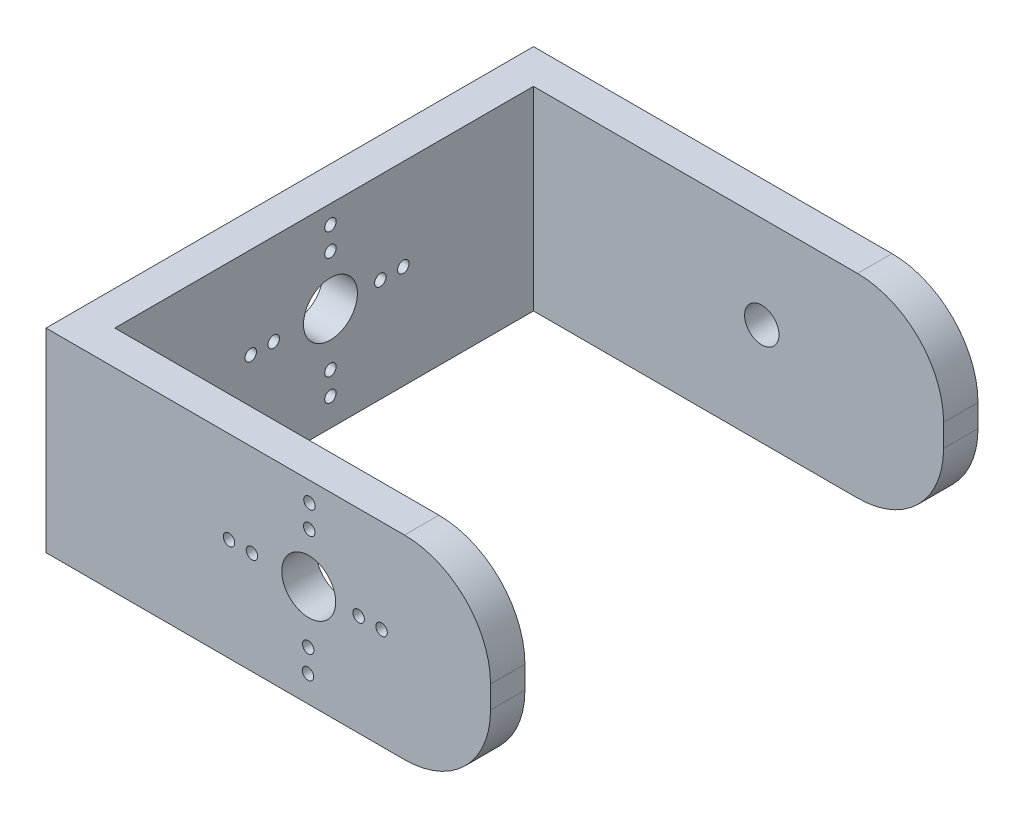
ISO-10303-21;
HEADER;
FILE_DESCRIPTION(('STEP AP214'),'2;1');
FILE_NAME('part.step','',(''),(''),'','','');
FILE_SCHEMA(('AUTOMOTIVE_DESIGN { 1 0 10303 214 1 1 1 1 }'));
ENDSEC;
DATA;
#1=APPLICATION_CONTEXT('core data for automotive mechanical design processes');
#2=APPLICATION_PROTOCOL_DEFINITION('international standard','automotive_design',2000,#1);
#3=PRODUCT_CONTEXT('',#1,'mechanical');
#4=PRODUCT('Part','Part','',(#3));
#5=PRODUCT_RELATED_PRODUCT_CATEGORY('part','',(#4));
#6=PRODUCT_DEFINITION_FORMATION('','',#4);
#7=PRODUCT_DEFINITION_CONTEXT('part definition',#1,'design');
#8=PRODUCT_DEFINITION('design','',#6,#7);
#9=PRODUCT_DEFINITION_SHAPE('','',#8);
#10=(LENGTH_UNIT() NAMED_UNIT(*) SI_UNIT(.MILLI.,.METRE.));
#11=(NAMED_UNIT(*) PLANE_ANGLE_UNIT() SI_UNIT($,.RADIAN.));
#12=(NAMED_UNIT(*) SI_UNIT($,.STERADIAN.) SOLID_ANGLE_UNIT());
#13=UNCERTAINTY_MEASURE_WITH_UNIT(LENGTH_MEASURE(1.E-05),#10,'distance_accuracy_value','');
#14=(GEOMETRIC_REPRESENTATION_CONTEXT(3) GLOBAL_UNCERTAINTY_ASSIGNED_CONTEXT((#13)) GLOBAL_UNIT_ASSIGNED_CONTEXT((#10,
#11,#12)) REPRESENTATION_CONTEXT('',''));
#15=CARTESIAN_POINT('',(0.,0.,0.));
#16=DIRECTION('',(0.,0.,1.));
#17=DIRECTION('',(1.,0.,0.));
#18=AXIS2_PLACEMENT_3D('',#15,#16,#17);
#19=CARTESIAN_POINT('',(-7.5,22.7723952514648,3.));
#20=DIRECTION('',(0.,0.,-1.));
#21=DIRECTION('',(-1.,0.,0.));
#22=AXIS2_PLACEMENT_3D('',#19,#20,#21);
#23=CYLINDRICAL_SURFACE('',#22,7.5);
#24=DIRECTION('',(0.,0.,-1.));
#25=VECTOR('',#24,1.);
#26=CARTESIAN_POINT('',(0.,22.7723952514648,3.));
#27=LINE('',#26,#25);
#28=CARTESIAN_POINT('',(0.,22.7723952514648,-36.4999999999999));
#29=VERTEX_POINT('',#28);
#30=CARTESIAN_POINT('',(0.,22.7723952514648,-39.4999999999999));
#31=VERTEX_POINT('',#30);
#32=EDGE_CURVE('E209',#29,#31,#27,.T.);
#33=ORIENTED_EDGE('',*,*,#32,.F.);
#34=CARTESIAN_POINT('',(-7.5,22.7723952514648,-36.4999999999999));
#35=DIRECTION('',(0.,0.,-1.));
#36=DIRECTION('',(-1.,0.,0.));
#37=AXIS2_PLACEMENT_3D('',#34,#35,#36);
#38=CIRCLE('',#37,7.5);
#39=CARTESIAN_POINT('',(-7.5,15.2723952514648,-36.4999999999999));
#40=VERTEX_POINT('',#39);
#41=EDGE_CURVE('E41',#40,#29,#38,.F.);
#42=ORIENTED_EDGE('',*,*,#41,.F.);
#43=DIRECTION('',(0.,0.,-1.));
#44=VECTOR('',#43,1.);
#45=CARTESIAN_POINT('',(-7.5,15.2723952514648,100.));
#46=LINE('',#45,#44);
#47=CARTESIAN_POINT('',(-7.5,15.2723952514648,-39.5));
#48=VERTEX_POINT('',#47);
#49=EDGE_CURVE('E212',#48,#40,#46,.F.);
#50=ORIENTED_EDGE('',*,*,#49,.F.);
#51=CARTESIAN_POINT('',(-7.5,22.7723952514648,-39.5));
#52=DIRECTION('',(0.,0.,1.));
#53=DIRECTION('',(1.,0.,0.));
#54=AXIS2_PLACEMENT_3D('',#51,#52,#53);
#55=CIRCLE('',#54,7.5);
#56=EDGE_CURVE('E11',#31,#48,#55,.F.);
#57=ORIENTED_EDGE('',*,*,#56,.F.);
#58=EDGE_LOOP('',(#33,#42,#50,#57));
#59=FACE_BOUND('',#58,.T.);
#60=ADVANCED_FACE('F33',(#59),#23,.T.);
#61=CARTESIAN_POINT('',(-7.5,24.7336587134231,100.));
#62=DIRECTION('',(0.,0.,-1.));
#63=DIRECTION('',(-1.,0.,0.));
#64=AXIS2_PLACEMENT_3D('',#61,#62,#63);
#65=CYLINDRICAL_SURFACE('',#64,7.5);
#66=DIRECTION('',(0.,0.,-1.));
#67=VECTOR('',#66,1.);
#68=CARTESIAN_POINT('',(-7.5,32.2336587134231,100.));
#69=LINE('',#68,#67);
#70=CARTESIAN_POINT('',(-7.5,32.2336587134231,-36.4999999999999));
#71=VERTEX_POINT('',#70);
#72=CARTESIAN_POINT('',(-7.5,32.2336587134231,-39.5));
#73=VERTEX_POINT('',#72);
#74=EDGE_CURVE('E199',#71,#73,#69,.T.);
#75=ORIENTED_EDGE('',*,*,#74,.F.);
#76=CARTESIAN_POINT('',(-7.5,24.7336587134231,-36.4999999999999));
#77=DIRECTION('',(0.,0.,-1.));
#78=DIRECTION('',(-1.,0.,0.));
#79=AXIS2_PLACEMENT_3D('',#76,#77,#78);
#80=CIRCLE('',#79,7.5);
#81=CARTESIAN_POINT('',(0.,24.7336587134231,-36.4999999999999));
#82=VERTEX_POINT('',#81);
#83=EDGE_CURVE('E205',#82,#71,#80,.F.);
#84=ORIENTED_EDGE('',*,*,#83,.F.);
#85=DIRECTION('',(0.,0.,-1.));
#86=VECTOR('',#85,1.);
#87=CARTESIAN_POINT('',(0.,24.7336587134231,3.));
#88=LINE('',#87,#86);
#89=CARTESIAN_POINT('',(0.,24.7336587134231,-39.4999999999999));
#90=VERTEX_POINT('',#89);
#91=EDGE_CURVE('E202',#90,#82,#88,.F.);
#92=ORIENTED_EDGE('',*,*,#91,.F.);
#93=CARTESIAN_POINT('',(-7.5,24.7336587134231,-39.5));
#94=DIRECTION('',(0.,0.,1.));
#95=DIRECTION('',(1.,0.,0.));
#96=AXIS2_PLACEMENT_3D('',#93,#94,#95);
#97=CIRCLE('',#96,7.5);
#98=EDGE_CURVE('E207',#73,#90,#97,.F.);
#99=ORIENTED_EDGE('',*,*,#98,.F.);
#100=EDGE_LOOP('',(#75,#84,#92,#99));
#101=FACE_BOUND('',#100,.T.);
#102=ADVANCED_FACE('F331',(#101),#65,.T.);
#103=CARTESIAN_POINT('',(-7.5,24.7336587134231,3.));
#104=DIRECTION('',(0.,0.,1.));
#105=DIRECTION('',(1.,0.,0.));
#106=AXIS2_PLACEMENT_3D('',#103,#104,#105);
#107=CYLINDRICAL_SURFACE('',#106,7.5);
#108=CARTESIAN_POINT('',(-7.5,24.7336587134231,0.));
#109=DIRECTION('',(0.,0.,1.));
#110=DIRECTION('',(1.,0.,0.));
#111=AXIS2_PLACEMENT_3D('',#108,#109,#110);
#112=CIRCLE('',#111,7.5);
#113=CARTESIAN_POINT('',(-7.5,32.2336587134231,0.));
#114=VERTEX_POINT('',#113);
#115=CARTESIAN_POINT('',(0.,24.7336587134231,0.));
#116=VERTEX_POINT('',#115);
#117=EDGE_CURVE('E189',#114,#116,#112,.F.);
#118=ORIENTED_EDGE('',*,*,#117,.F.);
#119=DIRECTION('',(0.,0.,1.));
#120=VECTOR('',#119,1.);
#121=CARTESIAN_POINT('',(-7.5,32.2336587134231,100.));
#122=LINE('',#121,#120);
#123=CARTESIAN_POINT('',(-7.5,32.2336587134231,3.));
#124=VERTEX_POINT('',#123);
#125=EDGE_CURVE('E195',#124,#114,#122,.F.);
#126=ORIENTED_EDGE('',*,*,#125,.F.);
#127=CARTESIAN_POINT('',(-7.5,24.7336587134231,3.));
#128=DIRECTION('',(0.,0.,1.));
#129=DIRECTION('',(1.,0.,0.));
#130=AXIS2_PLACEMENT_3D('',#127,#128,#129);
#131=CIRCLE('',#130,7.5);
#132=CARTESIAN_POINT('',(0.,24.7336587134231,3.));
#133=VERTEX_POINT('',#132);
#134=EDGE_CURVE('E197',#133,#124,#131,.T.);
#135=ORIENTED_EDGE('',*,*,#134,.F.);
#136=DIRECTION('',(0.,0.,1.));
#137=VECTOR('',#136,1.);
#138=CARTESIAN_POINT('',(0.,24.7336587134231,3.));
#139=LINE('',#138,#137);
#140=EDGE_CURVE('E192',#116,#133,#139,.T.);
#141=ORIENTED_EDGE('',*,*,#140,.F.);
#142=EDGE_LOOP('',(#118,#126,#135,#141));
#143=FACE_BOUND('',#142,.T.);
#144=ADVANCED_FACE('F317',(#143),#107,.T.);
#145=CARTESIAN_POINT('',(-7.5,22.7723952514648,100.));
#146=DIRECTION('',(0.,0.,1.));
#147=DIRECTION('',(1.,0.,0.));
#148=AXIS2_PLACEMENT_3D('',#145,#146,#147);
#149=CYLINDRICAL_SURFACE('',#148,7.5);
#150=DIRECTION('',(0.,0.,1.));
#151=VECTOR('',#150,1.);
#152=CARTESIAN_POINT('',(-7.5,15.2723952514648,100.));
#153=LINE('',#152,#151);
#154=CARTESIAN_POINT('',(-7.5,15.2723952514648,0.));
#155=VERTEX_POINT('',#154);
#156=CARTESIAN_POINT('',(-7.5,15.2723952514648,3.));
#157=VERTEX_POINT('',#156);
#158=EDGE_CURVE('E179',#155,#157,#153,.T.);
#159=ORIENTED_EDGE('',*,*,#158,.F.);
#160=CARTESIAN_POINT('',(-7.5,22.7723952514648,0.));
#161=DIRECTION('',(0.,0.,1.));
#162=DIRECTION('',(1.,0.,0.));
#163=AXIS2_PLACEMENT_3D('',#160,#161,#162);
#164=CIRCLE('',#163,7.5);
#165=CARTESIAN_POINT('',(0.,22.7723952514648,0.));
#166=VERTEX_POINT('',#165);
#167=EDGE_CURVE('E141',#166,#155,#164,.F.);
#168=ORIENTED_EDGE('',*,*,#167,.F.);
#169=DIRECTION('',(0.,0.,1.));
#170=VECTOR('',#169,1.);
#171=CARTESIAN_POINT('',(0.,22.7723952514648,3.));
#172=LINE('',#171,#170);
#173=CARTESIAN_POINT('',(0.,22.7723952514648,3.));
#174=VERTEX_POINT('',#173);
#175=EDGE_CURVE('E183',#174,#166,#172,.F.);
#176=ORIENTED_EDGE('',*,*,#175,.F.);
#177=CARTESIAN_POINT('',(-7.5,22.7723952514648,3.));
#178=DIRECTION('',(0.,0.,1.));
#179=DIRECTION('',(1.,0.,0.));
#180=AXIS2_PLACEMENT_3D('',#177,#178,#179);
#181=CIRCLE('',#180,7.5);
#182=EDGE_CURVE('E187',#157,#174,#181,.T.);
#183=ORIENTED_EDGE('',*,*,#182,.F.);
#184=EDGE_LOOP('',(#159,#168,#176,#183));
#185=FACE_BOUND('',#184,.T.);
#186=ADVANCED_FACE('F322',(#185),#149,.T.);
#187=CARTESIAN_POINT('',(-35.7542902682108,32.2336587134231,-60.7245307113419));
#188=DIRECTION('',(-1.,0.,0.));
#189=DIRECTION('',(0.,0.,1.));
#190=AXIS2_PLACEMENT_3D('',#187,#188,#189);
#191=PLANE('',#190);
#192=CARTESIAN_POINT('',(-35.7542902682108,24.2836576680459,-18.7992268238491));
#193=DIRECTION('',(-1.,0.,0.));
#194=DIRECTION('',(0.,0.,1.));
#195=AXIS2_PLACEMENT_3D('',#192,#193,#194);
#196=CIRCLE('',#195,2.35000000000011);
#197=CARTESIAN_POINT('',(-35.7542902682108,24.2836576680459,-16.449226823849));
#198=VERTEX_POINT('',#197);
#199=EDGE_CURVE('E654',#198,#198,#196,.T.);
#200=ORIENTED_EDGE('',*,*,#199,.T.);
#201=EDGE_LOOP('',(#200));
#202=FACE_BOUND('',#201,.T.);
#203=CARTESIAN_POINT('',(-35.7542902682108,24.2836576680459,-23.1492268238491));
#204=DIRECTION('',(-1.,0.,0.));
#205=DIRECTION('',(0.,0.,1.));
#206=AXIS2_PLACEMENT_3D('',#203,#204,#205);
#207=CIRCLE('',#206,0.500000000000082);
#208=CARTESIAN_POINT('',(-35.7542902682108,24.2836576680459,-22.649226823849));
#209=VERTEX_POINT('',#208);
#210=EDGE_CURVE('E291',#209,#209,#207,.T.);
#211=ORIENTED_EDGE('',*,*,#210,.T.);
#212=EDGE_LOOP('',(#211));
#213=FACE_BOUND('',#212,.T.);
#214=CARTESIAN_POINT('',(-35.7542902682108,17.6836576680457,-18.7992268238492));
#215=DIRECTION('',(-1.,0.,0.));
#216=DIRECTION('',(0.,0.,1.));
#217=AXIS2_PLACEMENT_3D('',#214,#215,#216);
#218=CIRCLE('',#217,0.500000000000122);
#219=CARTESIAN_POINT('',(-35.7542902682108,17.6836576680457,-18.2992268238491));
#220=VERTEX_POINT('',#219);
#221=EDGE_CURVE('E288',#220,#220,#218,.T.);
#222=ORIENTED_EDGE('',*,*,#221,.T.);
#223=EDGE_LOOP('',(#222));
#224=FACE_BOUND('',#223,.T.);
#225=CARTESIAN_POINT('',(-35.7542902682108,19.6836576680457,-18.7992268238492));
#226=DIRECTION('',(-1.,0.,0.));
#227=DIRECTION('',(0.,0.,1.));
#228=AXIS2_PLACEMENT_3D('',#225,#226,#227);
#229=CIRCLE('',#228,0.500000000000122);
#230=CARTESIAN_POINT('',(-35.7542902682108,19.6836576680457,-18.2992268238491));
#231=VERTEX_POINT('',#230);
#232=EDGE_CURVE('E285',#231,#231,#229,.T.);
#233=ORIENTED_EDGE('',*,*,#232,.T.);
#234=EDGE_LOOP('',(#233));
#235=FACE_BOUND('',#234,.T.);
#236=CARTESIAN_POINT('',(-35.7542902682108,24.2836576680458,-11.8492268238491));
#237=DIRECTION('',(-1.,0.,0.));
#238=DIRECTION('',(0.,0.,1.));
#239=AXIS2_PLACEMENT_3D('',#236,#237,#238);
#240=CIRCLE('',#239,0.500000000000076);
#241=CARTESIAN_POINT('',(-35.7542902682108,24.2836576680458,-11.349226823849));
#242=VERTEX_POINT('',#241);
#243=EDGE_CURVE('E282',#242,#242,#240,.T.);
#244=ORIENTED_EDGE('',*,*,#243,.T.);
#245=EDGE_LOOP('',(#244));
#246=FACE_BOUND('',#245,.T.);
#247=CARTESIAN_POINT('',(-35.7542902682108,28.6336576680459,-18.799226823849));
#248=DIRECTION('',(-1.,0.,0.));
#249=DIRECTION('',(0.,0.,1.));
#250=AXIS2_PLACEMENT_3D('',#247,#248,#249);
#251=CIRCLE('',#250,0.500000000000082);
#252=CARTESIAN_POINT('',(-35.7542902682108,28.6336576680459,-18.299226823849));
#253=VERTEX_POINT('',#252);
#254=EDGE_CURVE('E279',#253,#253,#251,.T.);
#255=ORIENTED_EDGE('',*,*,#254,.T.);
#256=EDGE_LOOP('',(#255));
#257=FACE_BOUND('',#256,.T.);
#258=CARTESIAN_POINT('',(-35.7542902682108,30.6336576680459,-18.799226823849));
#259=DIRECTION('',(-1.,0.,0.));
#260=DIRECTION('',(0.,0.,1.));
#261=AXIS2_PLACEMENT_3D('',#258,#259,#260);
#262=CIRCLE('',#261,0.500000000000104);
#263=CARTESIAN_POINT('',(-35.7542902682108,30.6336576680459,-18.2992268238489));
#264=VERTEX_POINT('',#263);
#265=EDGE_CURVE('E276',#264,#264,#262,.T.);
#266=ORIENTED_EDGE('',*,*,#265,.T.);
#267=EDGE_LOOP('',(#266));
#268=FACE_BOUND('',#267,.T.);
#269=CARTESIAN_POINT('',(-35.7542902682108,24.2836576680459,-25.1492268238491));
#270=DIRECTION('',(-1.,0.,0.));
#271=DIRECTION('',(0.,0.,1.));
#272=AXIS2_PLACEMENT_3D('',#269,#270,#271);
#273=CIRCLE('',#272,0.500000000000082);
#274=CARTESIAN_POINT('',(-35.7542902682108,24.2836576680459,-24.649226823849));
#275=VERTEX_POINT('',#274);
#276=EDGE_CURVE('E273',#275,#275,#273,.T.);
#277=ORIENTED_EDGE('',*,*,#276,.T.);
#278=EDGE_LOOP('',(#277));
#279=FACE_BOUND('',#278,.T.);
#280=CARTESIAN_POINT('',(-35.7542902682108,24.2836576680458,-13.8492268238491));
#281=DIRECTION('',(-1.,0.,0.));
#282=DIRECTION('',(0.,0.,1.));
#283=AXIS2_PLACEMENT_3D('',#280,#281,#282);
#284=CIRCLE('',#283,0.500000000000075);
#285=CARTESIAN_POINT('',(-35.7542902682108,24.2836576680458,-13.349226823849));
#286=VERTEX_POINT('',#285);
#287=EDGE_CURVE('E270',#286,#286,#284,.T.);
#288=ORIENTED_EDGE('',*,*,#287,.T.);
#289=EDGE_LOOP('',(#288));
#290=FACE_BOUND('',#289,.T.);
#291=DIRECTION('',(0.,-1.,0.));
#292=VECTOR('',#291,1.);
#293=CARTESIAN_POINT('',(-35.7542902682108,32.2336587134231,-36.4999999999999));
#294=LINE('',#293,#292);
#295=CARTESIAN_POINT('',(-35.7542902682108,32.2336587134231,-36.4999999999999));
#296=VERTEX_POINT('',#295);
#297=CARTESIAN_POINT('',(-35.7542902682108,15.2723952514648,-36.4999999999999));
#298=VERTEX_POINT('',#297);
#299=EDGE_CURVE('E294',#296,#298,#294,.T.);
#300=ORIENTED_EDGE('',*,*,#299,.F.);
#301=DIRECTION('',(0.,0.,1.));
#302=VECTOR('',#301,1.);
#303=CARTESIAN_POINT('',(-35.7542902682108,32.2336587134231,-60.7245307113419));
#304=LINE('',#303,#302);
#305=CARTESIAN_POINT('',(-35.7542902682108,32.2336587134231,0.));
#306=VERTEX_POINT('',#305);
#307=EDGE_CURVE('E133',#296,#306,#304,.T.);
#308=ORIENTED_EDGE('',*,*,#307,.T.);
#309=DIRECTION('',(0.,-1.,0.));
#310=VECTOR('',#309,1.);
#311=CARTESIAN_POINT('',(-35.7542902682108,32.2336587134231,0.));
#312=LINE('',#311,#310);
#313=CARTESIAN_POINT('',(-35.7542902682108,15.2723952514648,0.));
#314=VERTEX_POINT('',#313);
#315=EDGE_CURVE('E134',#306,#314,#312,.T.);
#316=ORIENTED_EDGE('',*,*,#315,.T.);
#317=DIRECTION('',(0.,0.,1.));
#318=VECTOR('',#317,1.);
#319=CARTESIAN_POINT('',(-35.7542902682108,15.2723952514648,-60.7245307113419));
#320=LINE('',#319,#318);
#321=EDGE_CURVE('E121',#298,#314,#320,.T.);
#322=ORIENTED_EDGE('',*,*,#321,.F.);
#323=EDGE_LOOP('',(#300,#308,#316,#322));
#324=FACE_BOUND('',#323,.T.);
#325=ADVANCED_FACE('F147',(#202,#213,#224,#235,#246,#257,#268,#279,#290,#324),#191,.F.);
#326=CARTESIAN_POINT('',(0.,0.,0.));
#327=DIRECTION('',(0.,0.,1.));
#328=DIRECTION('',(1.,0.,0.));
#329=AXIS2_PLACEMENT_3D('',#326,#327,#328);
#330=PLANE('',#329);
#331=CARTESIAN_POINT('',(-15.8492756338482,24.1661612303614,0.));
#332=DIRECTION('',(0.,0.,-1.));
#333=DIRECTION('',(-1.,0.,0.));
#334=AXIS2_PLACEMENT_3D('',#331,#332,#333);
#335=CIRCLE('',#334,2.34999999999975);
#336=CARTESIAN_POINT('',(-18.199275633848,24.1661612303614,0.));
#337=VERTEX_POINT('',#336);
#338=EDGE_CURVE('E645',#337,#337,#335,.T.);
#339=ORIENTED_EDGE('',*,*,#338,.F.);
#340=EDGE_LOOP('',(#339));
#341=FACE_BOUND('',#340,.T.);
#342=CARTESIAN_POINT('',(-15.7854733292532,30.5158406920294,0.));
#343=DIRECTION('',(0.,0.,-1.));
#344=DIRECTION('',(-1.,0.,0.));
#345=AXIS2_PLACEMENT_3D('',#342,#343,#344);
#346=CIRCLE('',#345,0.5);
#347=CARTESIAN_POINT('',(-16.2854733292532,30.5158406920294,0.));
#348=VERTEX_POINT('',#347);
#349=EDGE_CURVE('E219',#348,#348,#346,.T.);
#350=ORIENTED_EDGE('',*,*,#349,.F.);
#351=EDGE_LOOP('',(#350));
#352=FACE_BOUND('',#351,.T.);
#353=CARTESIAN_POINT('',(-15.915589840199,17.5664943883128,0.));
#354=DIRECTION('',(0.,0.,-1.));
#355=DIRECTION('',(-1.,0.,0.));
#356=AXIS2_PLACEMENT_3D('',#353,#354,#355);
#357=CIRCLE('',#356,0.499999999999484);
#358=CARTESIAN_POINT('',(-16.4155898401984,17.5664943883128,0.));
#359=VERTEX_POINT('',#358);
#360=EDGE_CURVE('E657',#359,#359,#357,.T.);
#361=ORIENTED_EDGE('',*,*,#360,.F.);
#362=EDGE_LOOP('',(#361));
#363=FACE_BOUND('',#362,.T.);
#364=CARTESIAN_POINT('',(-15.8954946261533,19.5663934313578,0.));
#365=DIRECTION('',(0.,0.,-1.));
#366=DIRECTION('',(-1.,0.,0.));
#367=AXIS2_PLACEMENT_3D('',#364,#365,#366);
#368=CIRCLE('',#367,0.499999999999557);
#369=CARTESIAN_POINT('',(-16.3954946261528,19.5663934313578,0.));
#370=VERTEX_POINT('',#369);
#371=EDGE_CURVE('E665',#370,#370,#368,.T.);
#372=ORIENTED_EDGE('',*,*,#371,.F.);
#373=EDGE_LOOP('',(#372));
#374=FACE_BOUND('',#373,.T.);
#375=CARTESIAN_POINT('',(-9.49959617218024,24.1023589257663,0.));
#376=DIRECTION('',(0.,0.,-1.));
#377=DIRECTION('',(-1.,0.,0.));
#378=AXIS2_PLACEMENT_3D('',#375,#376,#377);
#379=CIRCLE('',#378,0.49999999999982);
#380=CARTESIAN_POINT('',(-9.99959617218006,24.1023589257663,0.));
#381=VERTEX_POINT('',#380);
#382=EDGE_CURVE('E661',#381,#381,#379,.T.);
#383=ORIENTED_EDGE('',*,*,#382,.F.);
#384=EDGE_LOOP('',(#383));
#385=FACE_BOUND('',#384,.T.);
#386=CARTESIAN_POINT('',(-15.8055685432989,28.5159416489843,0.));
#387=DIRECTION('',(0.,0.,-1.));
#388=DIRECTION('',(-1.,0.,0.));
#389=AXIS2_PLACEMENT_3D('',#386,#387,#388);
#390=CIRCLE('',#389,0.499999999999921);
#391=CARTESIAN_POINT('',(-16.3055685432988,28.5159416489843,0.));
#392=VERTEX_POINT('',#391);
#393=EDGE_CURVE('E660',#392,#392,#390,.T.);
#394=ORIENTED_EDGE('',*,*,#393,.F.);
#395=EDGE_LOOP('',(#394));
#396=FACE_BOUND('',#395,.T.);
#397=CARTESIAN_POINT('',(-20.7990257653847,24.2158968851244,0.));
#398=DIRECTION('',(0.,0.,-1.));
#399=DIRECTION('',(-1.,0.,0.));
#400=AXIS2_PLACEMENT_3D('',#397,#398,#399);
#401=CIRCLE('',#400,0.499999999999686);
#402=CARTESIAN_POINT('',(-21.2990257653844,24.2158968851244,0.));
#403=VERTEX_POINT('',#402);
#404=EDGE_CURVE('E251',#403,#403,#401,.T.);
#405=ORIENTED_EDGE('',*,*,#404,.F.);
#406=EDGE_LOOP('',(#405));
#407=FACE_BOUND('',#406,.T.);
#408=CARTESIAN_POINT('',(-22.7989248084297,24.2359920991701,0.));
#409=DIRECTION('',(0.,0.,-1.));
#410=DIRECTION('',(-1.,0.,0.));
#411=AXIS2_PLACEMENT_3D('',#408,#409,#410);
#412=CIRCLE('',#411,0.499999999999662);
#413=CARTESIAN_POINT('',(-23.2989248084294,24.2359920991701,0.));
#414=VERTEX_POINT('',#413);
#415=EDGE_CURVE('E670',#414,#414,#412,.T.);
#416=ORIENTED_EDGE('',*,*,#415,.F.);
#417=EDGE_LOOP('',(#416));
#418=FACE_BOUND('',#417,.T.);
#419=CARTESIAN_POINT('',(-11.4994952152253,24.122454139812,0.));
#420=DIRECTION('',(0.,0.,-1.));
#421=DIRECTION('',(-1.,0.,0.));
#422=AXIS2_PLACEMENT_3D('',#419,#420,#421);
#423=CIRCLE('',#422,0.499999999999795);
#424=CARTESIAN_POINT('',(-11.9994952152251,24.122454139812,0.));
#425=VERTEX_POINT('',#424);
#426=EDGE_CURVE('E664',#425,#425,#423,.T.);
#427=ORIENTED_EDGE('',*,*,#426,.F.);
#428=EDGE_LOOP('',(#427));
#429=FACE_BOUND('',#428,.T.);
#430=DIRECTION('',(-1.,0.,0.));
#431=VECTOR('',#430,1.);
#432=CARTESIAN_POINT('',(-34.7542902682108,32.2336587134231,0.));
#433=LINE('',#432,#431);
#434=EDGE_CURVE('E144',#114,#306,#433,.T.);
#435=ORIENTED_EDGE('',*,*,#434,.F.);
#436=ORIENTED_EDGE('',*,*,#117,.T.);
#437=DIRECTION('',(0.,1.,0.));
#438=VECTOR('',#437,1.);
#439=CARTESIAN_POINT('',(0.,0.,0.));
#440=LINE('',#439,#438);
#441=EDGE_CURVE('E175',#166,#116,#440,.T.);
#442=ORIENTED_EDGE('',*,*,#441,.F.);
#443=ORIENTED_EDGE('',*,*,#167,.T.);
#444=DIRECTION('',(1.,0.,0.));
#445=VECTOR('',#444,1.);
#446=CARTESIAN_POINT('',(-34.7542902682108,15.2723952514648,0.));
#447=LINE('',#446,#445);
#448=EDGE_CURVE('E126',#314,#155,#447,.T.);
#449=ORIENTED_EDGE('',*,*,#448,.F.);
#450=ORIENTED_EDGE('',*,*,#315,.F.);
#451=EDGE_LOOP('',(#435,#436,#442,#443,#449,#450));
#452=FACE_BOUND('',#451,.T.);
#453=ADVANCED_FACE('F139',(#341,#352,#363,#374,#385,#396,#407,#418,#429,#452),#330,.F.);
#454=CARTESIAN_POINT('',(0.,0.,3.));
#455=DIRECTION('',(-1.,0.,0.));
#456=DIRECTION('',(0.,0.,1.));
#457=AXIS2_PLACEMENT_3D('',#454,#455,#456);
#458=PLANE('',#457);
#459=ORIENTED_EDGE('',*,*,#441,.T.);
#460=ORIENTED_EDGE('',*,*,#140,.T.);
#461=DIRECTION('',(0.,1.,0.));
#462=VECTOR('',#461,1.);
#463=CARTESIAN_POINT('',(0.,0.,3.));
#464=LINE('',#463,#462);
#465=EDGE_CURVE('E176',#174,#133,#464,.T.);
#466=ORIENTED_EDGE('',*,*,#465,.F.);
#467=ORIENTED_EDGE('',*,*,#175,.T.);
#468=EDGE_LOOP('',(#459,#460,#466,#467));
#469=FACE_BOUND('',#468,.T.);
#470=ADVANCED_FACE('F319',(#469),#458,.F.);
#471=CARTESIAN_POINT('',(0.,0.,3.));
#472=DIRECTION('',(0.,0.,1.));
#473=DIRECTION('',(1.,0.,0.));
#474=AXIS2_PLACEMENT_3D('',#471,#472,#473);
#475=PLANE('',#474);
#476=CARTESIAN_POINT('',(-15.8492756338482,24.1661612303614,3.));
#477=DIRECTION('',(0.,0.,1.));
#478=DIRECTION('',(1.,0.,0.));
#479=AXIS2_PLACEMENT_3D('',#476,#477,#478);
#480=CIRCLE('',#479,2.34999999999975);
#481=CARTESIAN_POINT('',(-13.4992756338485,24.1661612303614,3.));
#482=VERTEX_POINT('',#481);
#483=EDGE_CURVE('E36',#482,#482,#480,.T.);
#484=ORIENTED_EDGE('',*,*,#483,.F.);
#485=EDGE_LOOP('',(#484));
#486=FACE_BOUND('',#485,.T.);
#487=CARTESIAN_POINT('',(-15.7854733292532,30.5158406920294,3.));
#488=DIRECTION('',(0.,0.,1.));
#489=DIRECTION('',(1.,0.,0.));
#490=AXIS2_PLACEMENT_3D('',#487,#488,#489);
#491=CIRCLE('',#490,0.5);
#492=CARTESIAN_POINT('',(-15.2854733292532,30.5158406920294,3.));
#493=VERTEX_POINT('',#492);
#494=EDGE_CURVE('E236',#493,#493,#491,.T.);
#495=ORIENTED_EDGE('',*,*,#494,.F.);
#496=EDGE_LOOP('',(#495));
#497=FACE_BOUND('',#496,.T.);
#498=CARTESIAN_POINT('',(-15.915589840199,17.5664943883128,3.));
#499=DIRECTION('',(0.,0.,1.));
#500=DIRECTION('',(1.,0.,0.));
#501=AXIS2_PLACEMENT_3D('',#498,#499,#500);
#502=CIRCLE('',#501,0.499999999999484);
#503=CARTESIAN_POINT('',(-15.4155898401995,17.5664943883128,3.));
#504=VERTEX_POINT('',#503);
#505=EDGE_CURVE('E234',#504,#504,#502,.T.);
#506=ORIENTED_EDGE('',*,*,#505,.F.);
#507=EDGE_LOOP('',(#506));
#508=FACE_BOUND('',#507,.T.);
#509=CARTESIAN_POINT('',(-15.8954946261533,19.5663934313578,3.));
#510=DIRECTION('',(0.,0.,1.));
#511=DIRECTION('',(1.,0.,0.));
#512=AXIS2_PLACEMENT_3D('',#509,#510,#511);
#513=CIRCLE('',#512,0.499999999999557);
#514=CARTESIAN_POINT('',(-15.3954946261537,19.5663934313578,3.));
#515=VERTEX_POINT('',#514);
#516=EDGE_CURVE('E231',#515,#515,#513,.T.);
#517=ORIENTED_EDGE('',*,*,#516,.F.);
#518=EDGE_LOOP('',(#517));
#519=FACE_BOUND('',#518,.T.);
#520=CARTESIAN_POINT('',(-9.49959617218024,24.1023589257663,3.));
#521=DIRECTION('',(0.,0.,1.));
#522=DIRECTION('',(1.,0.,0.));
#523=AXIS2_PLACEMENT_3D('',#520,#521,#522);
#524=CIRCLE('',#523,0.49999999999982);
#525=CARTESIAN_POINT('',(-8.99959617218042,24.1023589257663,3.));
#526=VERTEX_POINT('',#525);
#527=EDGE_CURVE('E228',#526,#526,#524,.T.);
#528=ORIENTED_EDGE('',*,*,#527,.F.);
#529=EDGE_LOOP('',(#528));
#530=FACE_BOUND('',#529,.T.);
#531=CARTESIAN_POINT('',(-15.8055685432989,28.5159416489843,3.));
#532=DIRECTION('',(0.,0.,1.));
#533=DIRECTION('',(1.,0.,0.));
#534=AXIS2_PLACEMENT_3D('',#531,#532,#533);
#535=CIRCLE('',#534,0.499999999999921);
#536=CARTESIAN_POINT('',(-15.305568543299,28.5159416489843,3.));
#537=VERTEX_POINT('',#536);
#538=EDGE_CURVE('E225',#537,#537,#535,.T.);
#539=ORIENTED_EDGE('',*,*,#538,.F.);
#540=EDGE_LOOP('',(#539));
#541=FACE_BOUND('',#540,.T.);
#542=CARTESIAN_POINT('',(-20.7990257653847,24.2158968851244,3.));
#543=DIRECTION('',(0.,0.,1.));
#544=DIRECTION('',(1.,0.,0.));
#545=AXIS2_PLACEMENT_3D('',#542,#543,#544);
#546=CIRCLE('',#545,0.499999999999686);
#547=CARTESIAN_POINT('',(-20.299025765385,24.2158968851244,3.));
#548=VERTEX_POINT('',#547);
#549=EDGE_CURVE('E222',#548,#548,#546,.T.);
#550=ORIENTED_EDGE('',*,*,#549,.F.);
#551=EDGE_LOOP('',(#550));
#552=FACE_BOUND('',#551,.T.);
#553=CARTESIAN_POINT('',(-22.7989248084297,24.2359920991701,3.));
#554=DIRECTION('',(0.,0.,1.));
#555=DIRECTION('',(1.,0.,0.));
#556=AXIS2_PLACEMENT_3D('',#553,#554,#555);
#557=CIRCLE('',#556,0.499999999999662);
#558=CARTESIAN_POINT('',(-22.2989248084301,24.2359920991701,3.));
#559=VERTEX_POINT('',#558);
#560=EDGE_CURVE('E218',#559,#559,#557,.T.);
#561=ORIENTED_EDGE('',*,*,#560,.F.);
#562=EDGE_LOOP('',(#561));
#563=FACE_BOUND('',#562,.T.);
#564=CARTESIAN_POINT('',(-11.4994952152253,24.122454139812,3.));
#565=DIRECTION('',(0.,0.,1.));
#566=DIRECTION('',(1.,0.,0.));
#567=AXIS2_PLACEMENT_3D('',#564,#565,#566);
#568=CIRCLE('',#567,0.499999999999795);
#569=CARTESIAN_POINT('',(-10.9994952152255,24.122454139812,3.));
#570=VERTEX_POINT('',#569);
#571=EDGE_CURVE('E215',#570,#570,#568,.T.);
#572=ORIENTED_EDGE('',*,*,#571,.F.);
#573=EDGE_LOOP('',(#572));
#574=FACE_BOUND('',#573,.T.);
#575=ORIENTED_EDGE('',*,*,#465,.T.);
#576=ORIENTED_EDGE('',*,*,#134,.T.);
#577=DIRECTION('',(1.,0.,0.));
#578=VECTOR('',#577,1.);
#579=CARTESIAN_POINT('',(0.,32.2336587134231,3.));
#580=LINE('',#579,#578);
#581=CARTESIAN_POINT('',(-38.7542902682108,32.2336587134231,3.));
#582=VERTEX_POINT('',#581);
#583=EDGE_CURVE('E143',#582,#124,#580,.T.);
#584=ORIENTED_EDGE('',*,*,#583,.F.);
#585=DIRECTION('',(0.,1.,0.));
#586=VECTOR('',#585,1.);
#587=CARTESIAN_POINT('',(-38.7542902682108,32.2336587134231,3.));
#588=LINE('',#587,#586);
#589=CARTESIAN_POINT('',(-38.7542902682108,15.2723952514648,3.));
#590=VERTEX_POINT('',#589);
#591=EDGE_CURVE('E164',#590,#582,#588,.T.);
#592=ORIENTED_EDGE('',*,*,#591,.F.);
#593=DIRECTION('',(-1.,0.,0.));
#594=VECTOR('',#593,1.);
#595=CARTESIAN_POINT('',(0.,15.2723952514648,3.));
#596=LINE('',#595,#594);
#597=EDGE_CURVE('E173',#157,#590,#596,.T.);
#598=ORIENTED_EDGE('',*,*,#597,.F.);
#599=ORIENTED_EDGE('',*,*,#182,.T.);
#600=EDGE_LOOP('',(#575,#576,#584,#592,#598,#599));
#601=FACE_BOUND('',#600,.T.);
#602=ADVANCED_FACE('F310',(#486,#497,#508,#519,#530,#541,#552,#563,#574,#601),#475,.T.);
#603=CARTESIAN_POINT('',(-34.7542902682108,15.2723952514648,100.));
#604=DIRECTION('',(0.,1.,0.));
#605=DIRECTION('',(0.,0.,1.));
#606=AXIS2_PLACEMENT_3D('',#603,#604,#605);
#607=PLANE('',#606);
#608=DIRECTION('',(1.,0.,0.));
#609=VECTOR('',#608,1.);
#610=CARTESIAN_POINT('',(-38.7542902682108,15.2723952514648,-39.5));
#611=LINE('',#610,#609);
#612=CARTESIAN_POINT('',(-38.7542902682108,15.2723952514648,-39.5));
#613=VERTEX_POINT('',#612);
#614=EDGE_CURVE('E158',#613,#48,#611,.T.);
#615=ORIENTED_EDGE('',*,*,#614,.T.);
#616=ORIENTED_EDGE('',*,*,#49,.T.);
#617=DIRECTION('',(-1.,0.,0.));
#618=VECTOR('',#617,1.);
#619=CARTESIAN_POINT('',(17.2245307113419,15.2723952514648,-36.4999999999999));
#620=LINE('',#619,#618);
#621=EDGE_CURVE('E128',#40,#298,#620,.T.);
#622=ORIENTED_EDGE('',*,*,#621,.T.);
#623=ORIENTED_EDGE('',*,*,#321,.T.);
#624=ORIENTED_EDGE('',*,*,#448,.T.);
#625=ORIENTED_EDGE('',*,*,#158,.T.);
#626=ORIENTED_EDGE('',*,*,#597,.T.);
#627=DIRECTION('',(0.,0.,1.));
#628=VECTOR('',#627,1.);
#629=CARTESIAN_POINT('',(-38.7542902682108,15.2723952514648,0.));
#630=LINE('',#629,#628);
#631=EDGE_CURVE('E161',#613,#590,#630,.T.);
#632=ORIENTED_EDGE('',*,*,#631,.F.);
#633=EDGE_LOOP('',(#615,#616,#622,#623,#624,#625,#626,#632));
#634=FACE_BOUND('',#633,.T.);
#635=ADVANCED_FACE('F124',(#634),#607,.F.);
#636=CARTESIAN_POINT('',(-34.7542902682108,32.2336587134231,100.));
#637=DIRECTION('',(0.,-1.,0.));
#638=DIRECTION('',(0.,0.,-1.));
#639=AXIS2_PLACEMENT_3D('',#636,#637,#638);
#640=PLANE('',#639);
#641=DIRECTION('',(-1.,0.,0.));
#642=VECTOR('',#641,1.);
#643=CARTESIAN_POINT('',(17.2245307113419,32.2336587134231,-36.4999999999999));
#644=LINE('',#643,#642);
#645=EDGE_CURVE('E295',#71,#296,#644,.T.);
#646=ORIENTED_EDGE('',*,*,#645,.F.);
#647=ORIENTED_EDGE('',*,*,#74,.T.);
#648=DIRECTION('',(-1.,0.,0.));
#649=VECTOR('',#648,1.);
#650=CARTESIAN_POINT('',(-38.7542902682108,32.2336587134231,-39.5));
#651=LINE('',#650,#649);
#652=CARTESIAN_POINT('',(-38.7542902682108,32.2336587134231,-39.5));
#653=VERTEX_POINT('',#652);
#654=EDGE_CURVE('E160',#73,#653,#651,.T.);
#655=ORIENTED_EDGE('',*,*,#654,.T.);
#656=DIRECTION('',(0.,0.,-1.));
#657=VECTOR('',#656,1.);
#658=CARTESIAN_POINT('',(-38.7542902682108,32.2336587134231,0.));
#659=LINE('',#658,#657);
#660=EDGE_CURVE('E167',#582,#653,#659,.T.);
#661=ORIENTED_EDGE('',*,*,#660,.F.);
#662=ORIENTED_EDGE('',*,*,#583,.T.);
#663=ORIENTED_EDGE('',*,*,#125,.T.);
#664=ORIENTED_EDGE('',*,*,#434,.T.);
#665=ORIENTED_EDGE('',*,*,#307,.F.);
#666=EDGE_LOOP('',(#646,#647,#655,#661,#662,#663,#664,#665));
#667=FACE_BOUND('',#666,.T.);
#668=ADVANCED_FACE('F313',(#667),#640,.F.);
#669=CARTESIAN_POINT('',(-38.7542902682108,0.,0.));
#670=DIRECTION('',(-1.,0.,0.));
#671=DIRECTION('',(0.,0.,1.));
#672=AXIS2_PLACEMENT_3D('',#669,#670,#671);
#673=PLANE('',#672);
#674=CARTESIAN_POINT('',(-38.7542902682108,24.2836576680459,-18.7992268238491));
#675=DIRECTION('',(-1.,0.,0.));
#676=DIRECTION('',(0.,0.,1.));
#677=AXIS2_PLACEMENT_3D('',#674,#675,#676);
#678=CIRCLE('',#677,2.35000000000011);
#679=CARTESIAN_POINT('',(-38.7542902682108,24.2836576680459,-16.449226823849));
#680=VERTEX_POINT('',#679);
#681=EDGE_CURVE('E651',#680,#680,#678,.T.);
#682=ORIENTED_EDGE('',*,*,#681,.F.);
#683=EDGE_LOOP('',(#682));
#684=FACE_BOUND('',#683,.T.);
#685=CARTESIAN_POINT('',(-38.7542902682108,24.2836576680459,-23.1492268238491));
#686=DIRECTION('',(-1.,0.,0.));
#687=DIRECTION('',(0.,0.,1.));
#688=AXIS2_PLACEMENT_3D('',#685,#686,#687);
#689=CIRCLE('',#688,0.500000000000082);
#690=CARTESIAN_POINT('',(-38.7542902682108,24.2836576680459,-22.649226823849));
#691=VERTEX_POINT('',#690);
#692=EDGE_CURVE('E254',#691,#691,#689,.T.);
#693=ORIENTED_EDGE('',*,*,#692,.F.);
#694=EDGE_LOOP('',(#693));
#695=FACE_BOUND('',#694,.T.);
#696=CARTESIAN_POINT('',(-38.7542902682108,17.6836576680457,-18.7992268238492));
#697=DIRECTION('',(-1.,0.,0.));
#698=DIRECTION('',(0.,0.,1.));
#699=AXIS2_PLACEMENT_3D('',#696,#697,#698);
#700=CIRCLE('',#699,0.500000000000122);
#701=CARTESIAN_POINT('',(-38.7542902682108,17.6836576680457,-18.2992268238491));
#702=VERTEX_POINT('',#701);
#703=EDGE_CURVE('E256',#702,#702,#700,.T.);
#704=ORIENTED_EDGE('',*,*,#703,.F.);
#705=EDGE_LOOP('',(#704));
#706=FACE_BOUND('',#705,.T.);
#707=CARTESIAN_POINT('',(-38.7542902682108,19.6836576680457,-18.7992268238492));
#708=DIRECTION('',(-1.,0.,0.));
#709=DIRECTION('',(0.,0.,1.));
#710=AXIS2_PLACEMENT_3D('',#707,#708,#709);
#711=CIRCLE('',#710,0.500000000000122);
#712=CARTESIAN_POINT('',(-38.7542902682108,19.6836576680457,-18.2992268238491));
#713=VERTEX_POINT('',#712);
#714=EDGE_CURVE('E259',#713,#713,#711,.T.);
#715=ORIENTED_EDGE('',*,*,#714,.F.);
#716=EDGE_LOOP('',(#715));
#717=FACE_BOUND('',#716,.T.);
#718=CARTESIAN_POINT('',(-38.7542902682108,24.2836576680458,-11.8492268238491));
#719=DIRECTION('',(-1.,0.,0.));
#720=DIRECTION('',(0.,0.,1.));
#721=AXIS2_PLACEMENT_3D('',#718,#719,#720);
#722=CIRCLE('',#721,0.500000000000076);
#723=CARTESIAN_POINT('',(-38.7542902682108,24.2836576680458,-11.349226823849));
#724=VERTEX_POINT('',#723);
#725=EDGE_CURVE('E262',#724,#724,#722,.T.);
#726=ORIENTED_EDGE('',*,*,#725,.F.);
#727=EDGE_LOOP('',(#726));
#728=FACE_BOUND('',#727,.T.);
#729=CARTESIAN_POINT('',(-38.7542902682108,28.6336576680459,-18.799226823849));
#730=DIRECTION('',(-1.,0.,0.));
#731=DIRECTION('',(0.,0.,1.));
#732=AXIS2_PLACEMENT_3D('',#729,#730,#731);
#733=CIRCLE('',#732,0.500000000000082);
#734=CARTESIAN_POINT('',(-38.7542902682108,28.6336576680459,-18.299226823849));
#735=VERTEX_POINT('',#734);
#736=EDGE_CURVE('E238',#735,#735,#733,.T.);
#737=ORIENTED_EDGE('',*,*,#736,.F.);
#738=EDGE_LOOP('',(#737));
#739=FACE_BOUND('',#738,.T.);
#740=CARTESIAN_POINT('',(-38.7542902682108,30.6336576680459,-18.799226823849));
#741=DIRECTION('',(-1.,0.,0.));
#742=DIRECTION('',(0.,0.,1.));
#743=AXIS2_PLACEMENT_3D('',#740,#741,#742);
#744=CIRCLE('',#743,0.500000000000104);
#745=CARTESIAN_POINT('',(-38.7542902682108,30.6336576680459,-18.2992268238489));
#746=VERTEX_POINT('',#745);
#747=EDGE_CURVE('E242',#746,#746,#744,.T.);
#748=ORIENTED_EDGE('',*,*,#747,.F.);
#749=EDGE_LOOP('',(#748));
#750=FACE_BOUND('',#749,.T.);
#751=CARTESIAN_POINT('',(-38.7542902682108,24.2836576680459,-25.1492268238491));
#752=DIRECTION('',(-1.,0.,0.));
#753=DIRECTION('',(0.,0.,1.));
#754=AXIS2_PLACEMENT_3D('',#751,#752,#753);
#755=CIRCLE('',#754,0.500000000000082);
#756=CARTESIAN_POINT('',(-38.7542902682108,24.2836576680459,-24.649226823849));
#757=VERTEX_POINT('',#756);
#758=EDGE_CURVE('E247',#757,#757,#755,.T.);
#759=ORIENTED_EDGE('',*,*,#758,.F.);
#760=EDGE_LOOP('',(#759));
#761=FACE_BOUND('',#760,.T.);
#762=CARTESIAN_POINT('',(-38.7542902682108,24.2836576680458,-13.8492268238491));
#763=DIRECTION('',(-1.,0.,0.));
#764=DIRECTION('',(0.,0.,1.));
#765=AXIS2_PLACEMENT_3D('',#762,#763,#764);
#766=CIRCLE('',#765,0.500000000000075);
#767=CARTESIAN_POINT('',(-38.7542902682108,24.2836576680458,-13.349226823849));
#768=VERTEX_POINT('',#767);
#769=EDGE_CURVE('E265',#768,#768,#766,.T.);
#770=ORIENTED_EDGE('',*,*,#769,.F.);
#771=EDGE_LOOP('',(#770));
#772=FACE_BOUND('',#771,.T.);
#773=ORIENTED_EDGE('',*,*,#660,.T.);
#774=DIRECTION('',(0.,-1.,0.));
#775=VECTOR('',#774,1.);
#776=CARTESIAN_POINT('',(-38.7542902682108,32.2336587134231,-39.5));
#777=LINE('',#776,#775);
#778=EDGE_CURVE('E154',#653,#613,#777,.T.);
#779=ORIENTED_EDGE('',*,*,#778,.T.);
#780=ORIENTED_EDGE('',*,*,#631,.T.);
#781=ORIENTED_EDGE('',*,*,#591,.T.);
#782=EDGE_LOOP('',(#773,#779,#780,#781));
#783=FACE_BOUND('',#782,.T.);
#784=ADVANCED_FACE('F305',(#684,#695,#706,#717,#728,#739,#750,#761,#772,#783),#673,.T.);
#785=CARTESIAN_POINT('',(4.78492153056997,29.6244033814496,-39.5));
#786=DIRECTION('',(0.,0.,1.));
#787=DIRECTION('',(0.938532485535377,0.345190923395715,0.));
#788=AXIS2_PLACEMENT_3D('',#785,#786,#787);
#789=PLANE('',#788);
#790=CARTESIAN_POINT('',(-15.8492756338482,24.1661612303614,-39.5));
#791=DIRECTION('',(0.,0.,1.));
#792=DIRECTION('',(1.,0.,0.));
#793=AXIS2_PLACEMENT_3D('',#790,#791,#792);
#794=CIRCLE('',#793,1.49999999999983);
#795=CARTESIAN_POINT('',(-14.3492756338484,24.1661612303614,-39.5));
#796=VERTEX_POINT('',#795);
#797=EDGE_CURVE('E644',#796,#796,#794,.T.);
#798=ORIENTED_EDGE('',*,*,#797,.T.);
#799=EDGE_LOOP('',(#798));
#800=FACE_BOUND('',#799,.T.);
#801=DIRECTION('',(0.,-1.,0.));
#802=VECTOR('',#801,1.);
#803=CARTESIAN_POINT('',(0.,32.2336587134231,-39.4999999999999));
#804=LINE('',#803,#802);
#805=EDGE_CURVE('E149',#90,#31,#804,.T.);
#806=ORIENTED_EDGE('',*,*,#805,.T.);
#807=ORIENTED_EDGE('',*,*,#56,.T.);
#808=ORIENTED_EDGE('',*,*,#614,.F.);
#809=ORIENTED_EDGE('',*,*,#778,.F.);
#810=ORIENTED_EDGE('',*,*,#654,.F.);
#811=ORIENTED_EDGE('',*,*,#98,.T.);
#812=EDGE_LOOP('',(#806,#807,#808,#809,#810,#811));
#813=FACE_BOUND('',#812,.T.);
#814=ADVANCED_FACE('F307',(#800,#813),#789,.F.);
#815=CARTESIAN_POINT('',(17.2245307113419,32.2336587134231,-36.4999999999999));
#816=DIRECTION('',(0.,0.,-1.));
#817=DIRECTION('',(-1.,0.,0.));
#818=AXIS2_PLACEMENT_3D('',#815,#816,#817);
#819=PLANE('',#818);
#820=CARTESIAN_POINT('',(-15.8492756338482,24.1661612303614,-36.4999999999999));
#821=DIRECTION('',(0.,0.,1.));
#822=DIRECTION('',(1.,0.,0.));
#823=AXIS2_PLACEMENT_3D('',#820,#821,#822);
#824=CIRCLE('',#823,1.49999999999983);
#825=CARTESIAN_POINT('',(-14.3492756338484,24.1661612303614,-36.4999999999999));
#826=VERTEX_POINT('',#825);
#827=EDGE_CURVE('E641',#826,#826,#824,.T.);
#828=ORIENTED_EDGE('',*,*,#827,.F.);
#829=EDGE_LOOP('',(#828));
#830=FACE_BOUND('',#829,.T.);
#831=ORIENTED_EDGE('',*,*,#621,.F.);
#832=ORIENTED_EDGE('',*,*,#41,.T.);
#833=DIRECTION('',(0.,1.,0.));
#834=VECTOR('',#833,1.);
#835=CARTESIAN_POINT('',(0.,32.2336587134231,-36.4999999999999));
#836=LINE('',#835,#834);
#837=EDGE_CURVE('E151',#29,#82,#836,.T.);
#838=ORIENTED_EDGE('',*,*,#837,.T.);
#839=ORIENTED_EDGE('',*,*,#83,.T.);
#840=ORIENTED_EDGE('',*,*,#645,.T.);
#841=ORIENTED_EDGE('',*,*,#299,.T.);
#842=EDGE_LOOP('',(#831,#832,#838,#839,#840,#841));
#843=FACE_BOUND('',#842,.T.);
#844=ADVANCED_FACE('F347',(#830,#843),#819,.F.);
#845=CARTESIAN_POINT('',(0.,0.,3.));
#846=DIRECTION('',(-1.,0.,0.));
#847=DIRECTION('',(0.,0.,1.));
#848=AXIS2_PLACEMENT_3D('',#845,#846,#847);
#849=PLANE('',#848);
#850=ORIENTED_EDGE('',*,*,#837,.F.);
#851=ORIENTED_EDGE('',*,*,#32,.T.);
#852=ORIENTED_EDGE('',*,*,#805,.F.);
#853=ORIENTED_EDGE('',*,*,#91,.T.);
#854=EDGE_LOOP('',(#850,#851,#852,#853));
#855=FACE_BOUND('',#854,.T.);
#856=ADVANCED_FACE('F343',(#855),#849,.F.);
#857=CARTESIAN_POINT('',(-24.7542902682108,24.2836576680458,-13.8492268238491));
#858=DIRECTION('',(-1.,0.,0.));
#859=DIRECTION('',(0.,0.,1.));
#860=AXIS2_PLACEMENT_3D('',#857,#858,#859);
#861=CYLINDRICAL_SURFACE('',#860,0.500000000000075);
#862=ORIENTED_EDGE('',*,*,#769,.T.);
#863=EDGE_LOOP('',(#862));
#864=FACE_BOUND('',#863,.T.);
#865=ORIENTED_EDGE('',*,*,#287,.F.);
#866=EDGE_LOOP('',(#865));
#867=FACE_BOUND('',#866,.T.);
#868=ADVANCED_FACE('F356',(#864,#867),#861,.F.);
#869=CARTESIAN_POINT('',(-24.7542902682108,24.2836576680459,-25.1492268238491));
#870=DIRECTION('',(-1.,0.,0.));
#871=DIRECTION('',(0.,0.,1.));
#872=AXIS2_PLACEMENT_3D('',#869,#870,#871);
#873=CYLINDRICAL_SURFACE('',#872,0.500000000000082);
#874=ORIENTED_EDGE('',*,*,#758,.T.);
#875=EDGE_LOOP('',(#874));
#876=FACE_BOUND('',#875,.T.);
#877=ORIENTED_EDGE('',*,*,#276,.F.);
#878=EDGE_LOOP('',(#877));
#879=FACE_BOUND('',#878,.T.);
#880=ADVANCED_FACE('F421',(#876,#879),#873,.F.);
#881=CARTESIAN_POINT('',(-24.7542902682108,30.6336576680459,-18.799226823849));
#882=DIRECTION('',(-1.,0.,0.));
#883=DIRECTION('',(0.,0.,1.));
#884=AXIS2_PLACEMENT_3D('',#881,#882,#883);
#885=CYLINDRICAL_SURFACE('',#884,0.500000000000104);
#886=ORIENTED_EDGE('',*,*,#747,.T.);
#887=EDGE_LOOP('',(#886));
#888=FACE_BOUND('',#887,.T.);
#889=ORIENTED_EDGE('',*,*,#265,.F.);
#890=EDGE_LOOP('',(#889));
#891=FACE_BOUND('',#890,.T.);
#892=ADVANCED_FACE('F430',(#888,#891),#885,.F.);
#893=CARTESIAN_POINT('',(-24.7542902682108,28.6336576680459,-18.799226823849));
#894=DIRECTION('',(-1.,0.,0.));
#895=DIRECTION('',(0.,0.,1.));
#896=AXIS2_PLACEMENT_3D('',#893,#894,#895);
#897=CYLINDRICAL_SURFACE('',#896,0.500000000000082);
#898=ORIENTED_EDGE('',*,*,#736,.T.);
#899=EDGE_LOOP('',(#898));
#900=FACE_BOUND('',#899,.T.);
#901=ORIENTED_EDGE('',*,*,#254,.F.);
#902=EDGE_LOOP('',(#901));
#903=FACE_BOUND('',#902,.T.);
#904=ADVANCED_FACE('F440',(#900,#903),#897,.F.);
#905=CARTESIAN_POINT('',(-24.7542902682108,24.2836576680458,-11.8492268238491));
#906=DIRECTION('',(-1.,0.,0.));
#907=DIRECTION('',(0.,0.,1.));
#908=AXIS2_PLACEMENT_3D('',#905,#906,#907);
#909=CYLINDRICAL_SURFACE('',#908,0.500000000000076);
#910=ORIENTED_EDGE('',*,*,#725,.T.);
#911=EDGE_LOOP('',(#910));
#912=FACE_BOUND('',#911,.T.);
#913=ORIENTED_EDGE('',*,*,#243,.F.);
#914=EDGE_LOOP('',(#913));
#915=FACE_BOUND('',#914,.T.);
#916=ADVANCED_FACE('F450',(#912,#915),#909,.F.);
#917=CARTESIAN_POINT('',(-24.7542902682108,19.6836576680457,-18.7992268238492));
#918=DIRECTION('',(-1.,0.,0.));
#919=DIRECTION('',(0.,0.,1.));
#920=AXIS2_PLACEMENT_3D('',#917,#918,#919);
#921=CYLINDRICAL_SURFACE('',#920,0.500000000000122);
#922=ORIENTED_EDGE('',*,*,#714,.T.);
#923=EDGE_LOOP('',(#922));
#924=FACE_BOUND('',#923,.T.);
#925=ORIENTED_EDGE('',*,*,#232,.F.);
#926=EDGE_LOOP('',(#925));
#927=FACE_BOUND('',#926,.T.);
#928=ADVANCED_FACE('F459',(#924,#927),#921,.F.);
#929=CARTESIAN_POINT('',(-24.7542902682108,17.6836576680457,-18.7992268238492));
#930=DIRECTION('',(-1.,0.,0.));
#931=DIRECTION('',(0.,0.,1.));
#932=AXIS2_PLACEMENT_3D('',#929,#930,#931);
#933=CYLINDRICAL_SURFACE('',#932,0.500000000000122);
#934=ORIENTED_EDGE('',*,*,#703,.T.);
#935=EDGE_LOOP('',(#934));
#936=FACE_BOUND('',#935,.T.);
#937=ORIENTED_EDGE('',*,*,#221,.F.);
#938=EDGE_LOOP('',(#937));
#939=FACE_BOUND('',#938,.T.);
#940=ADVANCED_FACE('F469',(#936,#939),#933,.F.);
#941=CARTESIAN_POINT('',(-24.7542902682108,24.2836576680459,-23.1492268238491));
#942=DIRECTION('',(-1.,0.,0.));
#943=DIRECTION('',(0.,0.,1.));
#944=AXIS2_PLACEMENT_3D('',#941,#942,#943);
#945=CYLINDRICAL_SURFACE('',#944,0.500000000000082);
#946=ORIENTED_EDGE('',*,*,#692,.T.);
#947=EDGE_LOOP('',(#946));
#948=FACE_BOUND('',#947,.T.);
#949=ORIENTED_EDGE('',*,*,#210,.F.);
#950=EDGE_LOOP('',(#949));
#951=FACE_BOUND('',#950,.T.);
#952=ADVANCED_FACE('F479',(#948,#951),#945,.F.);
#953=CARTESIAN_POINT('',(-11.4994952152253,24.122454139812,14.));
#954=DIRECTION('',(0.,0.,-1.));
#955=DIRECTION('',(-1.,0.,0.));
#956=AXIS2_PLACEMENT_3D('',#953,#954,#955);
#957=CYLINDRICAL_SURFACE('',#956,0.499999999999795);
#958=ORIENTED_EDGE('',*,*,#571,.T.);
#959=EDGE_LOOP('',(#958));
#960=FACE_BOUND('',#959,.T.);
#961=ORIENTED_EDGE('',*,*,#426,.T.);
#962=EDGE_LOOP('',(#961));
#963=FACE_BOUND('',#962,.T.);
#964=ADVANCED_FACE('F489',(#960,#963),#957,.F.);
#965=CARTESIAN_POINT('',(-22.7989248084297,24.2359920991701,14.));
#966=DIRECTION('',(0.,0.,-1.));
#967=DIRECTION('',(-1.,0.,0.));
#968=AXIS2_PLACEMENT_3D('',#965,#966,#967);
#969=CYLINDRICAL_SURFACE('',#968,0.499999999999662);
#970=ORIENTED_EDGE('',*,*,#560,.T.);
#971=EDGE_LOOP('',(#970));
#972=FACE_BOUND('',#971,.T.);
#973=ORIENTED_EDGE('',*,*,#415,.T.);
#974=EDGE_LOOP('',(#973));
#975=FACE_BOUND('',#974,.T.);
#976=ADVANCED_FACE('F499',(#972,#975),#969,.F.);
#977=CARTESIAN_POINT('',(-20.7990257653847,24.2158968851244,14.));
#978=DIRECTION('',(0.,0.,-1.));
#979=DIRECTION('',(-1.,0.,0.));
#980=AXIS2_PLACEMENT_3D('',#977,#978,#979);
#981=CYLINDRICAL_SURFACE('',#980,0.499999999999686);
#982=ORIENTED_EDGE('',*,*,#549,.T.);
#983=EDGE_LOOP('',(#982));
#984=FACE_BOUND('',#983,.T.);
#985=ORIENTED_EDGE('',*,*,#404,.T.);
#986=EDGE_LOOP('',(#985));
#987=FACE_BOUND('',#986,.T.);
#988=ADVANCED_FACE('F509',(#984,#987),#981,.F.);
#989=CARTESIAN_POINT('',(-15.8055685432989,28.5159416489843,14.));
#990=DIRECTION('',(0.,0.,-1.));
#991=DIRECTION('',(-1.,0.,0.));
#992=AXIS2_PLACEMENT_3D('',#989,#990,#991);
#993=CYLINDRICAL_SURFACE('',#992,0.499999999999921);
#994=ORIENTED_EDGE('',*,*,#538,.T.);
#995=EDGE_LOOP('',(#994));
#996=FACE_BOUND('',#995,.T.);
#997=ORIENTED_EDGE('',*,*,#393,.T.);
#998=EDGE_LOOP('',(#997));
#999=FACE_BOUND('',#998,.T.);
#1000=ADVANCED_FACE('F519',(#996,#999),#993,.F.);
#1001=CARTESIAN_POINT('',(-9.49959617218024,24.1023589257663,14.));
#1002=DIRECTION('',(0.,0.,-1.));
#1003=DIRECTION('',(-1.,0.,0.));
#1004=AXIS2_PLACEMENT_3D('',#1001,#1002,#1003);
#1005=CYLINDRICAL_SURFACE('',#1004,0.49999999999982);
#1006=ORIENTED_EDGE('',*,*,#527,.T.);
#1007=EDGE_LOOP('',(#1006));
#1008=FACE_BOUND('',#1007,.T.);
#1009=ORIENTED_EDGE('',*,*,#382,.T.);
#1010=EDGE_LOOP('',(#1009));
#1011=FACE_BOUND('',#1010,.T.);
#1012=ADVANCED_FACE('F529',(#1008,#1011),#1005,.F.);
#1013=CARTESIAN_POINT('',(-15.8954946261533,19.5663934313578,14.));
#1014=DIRECTION('',(0.,0.,-1.));
#1015=DIRECTION('',(-1.,0.,0.));
#1016=AXIS2_PLACEMENT_3D('',#1013,#1014,#1015);
#1017=CYLINDRICAL_SURFACE('',#1016,0.499999999999557);
#1018=ORIENTED_EDGE('',*,*,#516,.T.);
#1019=EDGE_LOOP('',(#1018));
#1020=FACE_BOUND('',#1019,.T.);
#1021=ORIENTED_EDGE('',*,*,#371,.T.);
#1022=EDGE_LOOP('',(#1021));
#1023=FACE_BOUND('',#1022,.T.);
#1024=ADVANCED_FACE('F539',(#1020,#1023),#1017,.F.);
#1025=CARTESIAN_POINT('',(-15.915589840199,17.5664943883128,14.));
#1026=DIRECTION('',(0.,0.,-1.));
#1027=DIRECTION('',(-1.,0.,0.));
#1028=AXIS2_PLACEMENT_3D('',#1025,#1026,#1027);
#1029=CYLINDRICAL_SURFACE('',#1028,0.499999999999484);
#1030=ORIENTED_EDGE('',*,*,#505,.T.);
#1031=EDGE_LOOP('',(#1030));
#1032=FACE_BOUND('',#1031,.T.);
#1033=ORIENTED_EDGE('',*,*,#360,.T.);
#1034=EDGE_LOOP('',(#1033));
#1035=FACE_BOUND('',#1034,.T.);
#1036=ADVANCED_FACE('F549',(#1032,#1035),#1029,.F.);
#1037=CARTESIAN_POINT('',(-15.7854733292532,30.5158406920294,14.));
#1038=DIRECTION('',(0.,0.,-1.));
#1039=DIRECTION('',(-1.,0.,0.));
#1040=AXIS2_PLACEMENT_3D('',#1037,#1038,#1039);
#1041=CYLINDRICAL_SURFACE('',#1040,0.5);
#1042=ORIENTED_EDGE('',*,*,#494,.T.);
#1043=EDGE_LOOP('',(#1042));
#1044=FACE_BOUND('',#1043,.T.);
#1045=ORIENTED_EDGE('',*,*,#349,.T.);
#1046=EDGE_LOOP('',(#1045));
#1047=FACE_BOUND('',#1046,.T.);
#1048=ADVANCED_FACE('F559',(#1044,#1047),#1041,.F.);
#1049=CARTESIAN_POINT('',(-28.7542902682108,24.2836576680459,-18.7992268238491));
#1050=DIRECTION('',(-1.,0.,0.));
#1051=DIRECTION('',(0.,0.,1.));
#1052=AXIS2_PLACEMENT_3D('',#1049,#1050,#1051);
#1053=CYLINDRICAL_SURFACE('',#1052,2.35000000000011);
#1054=ORIENTED_EDGE('',*,*,#681,.T.);
#1055=EDGE_LOOP('',(#1054));
#1056=FACE_BOUND('',#1055,.T.);
#1057=ORIENTED_EDGE('',*,*,#199,.F.);
#1058=EDGE_LOOP('',(#1057));
#1059=FACE_BOUND('',#1058,.T.);
#1060=ADVANCED_FACE('F569',(#1056,#1059),#1053,.F.);
#1061=CARTESIAN_POINT('',(-15.8492756338482,24.1661612303614,10.));
#1062=DIRECTION('',(0.,0.,-1.));
#1063=DIRECTION('',(-1.,0.,0.));
#1064=AXIS2_PLACEMENT_3D('',#1061,#1062,#1063);
#1065=CYLINDRICAL_SURFACE('',#1064,2.34999999999975);
#1066=ORIENTED_EDGE('',*,*,#483,.T.);
#1067=EDGE_LOOP('',(#1066));
#1068=FACE_BOUND('',#1067,.T.);
#1069=ORIENTED_EDGE('',*,*,#338,.T.);
#1070=EDGE_LOOP('',(#1069));
#1071=FACE_BOUND('',#1070,.T.);
#1072=ADVANCED_FACE('F591',(#1068,#1071),#1065,.F.);
#1073=CARTESIAN_POINT('',(-15.8492756338482,24.1661612303614,-46.4999999999999));
#1074=DIRECTION('',(0.,0.,1.));
#1075=DIRECTION('',(1.,0.,0.));
#1076=AXIS2_PLACEMENT_3D('',#1073,#1074,#1075);
#1077=CYLINDRICAL_SURFACE('',#1076,1.49999999999983);
#1078=ORIENTED_EDGE('',*,*,#827,.T.);
#1079=EDGE_LOOP('',(#1078));
#1080=FACE_BOUND('',#1079,.T.);
#1081=ORIENTED_EDGE('',*,*,#797,.F.);
#1082=EDGE_LOOP('',(#1081));
#1083=FACE_BOUND('',#1082,.T.);
#1084=ADVANCED_FACE('F617',(#1080,#1083),#1077,.F.);
#1085=CLOSED_SHELL('',(#60,#102,#144,#186,#325,#453,#470,#602,#635,#668,#784,#814,#844,#856,
#868,#880,#892,#904,#916,#928,#940,#952,#964,#976,#988,#1000,#1012,#1024,#1036,#1048,#1060,
#1072,#1084));
#1086=MANIFOLD_SOLID_BREP('B2',#1085);
#1087=ADVANCED_BREP_SHAPE_REPRESENTATION('',(#18,#1086),#14);
#1088=SHAPE_DEFINITION_REPRESENTATION(#9,#1087);
ENDSEC;
END-ISO-10303-21;
